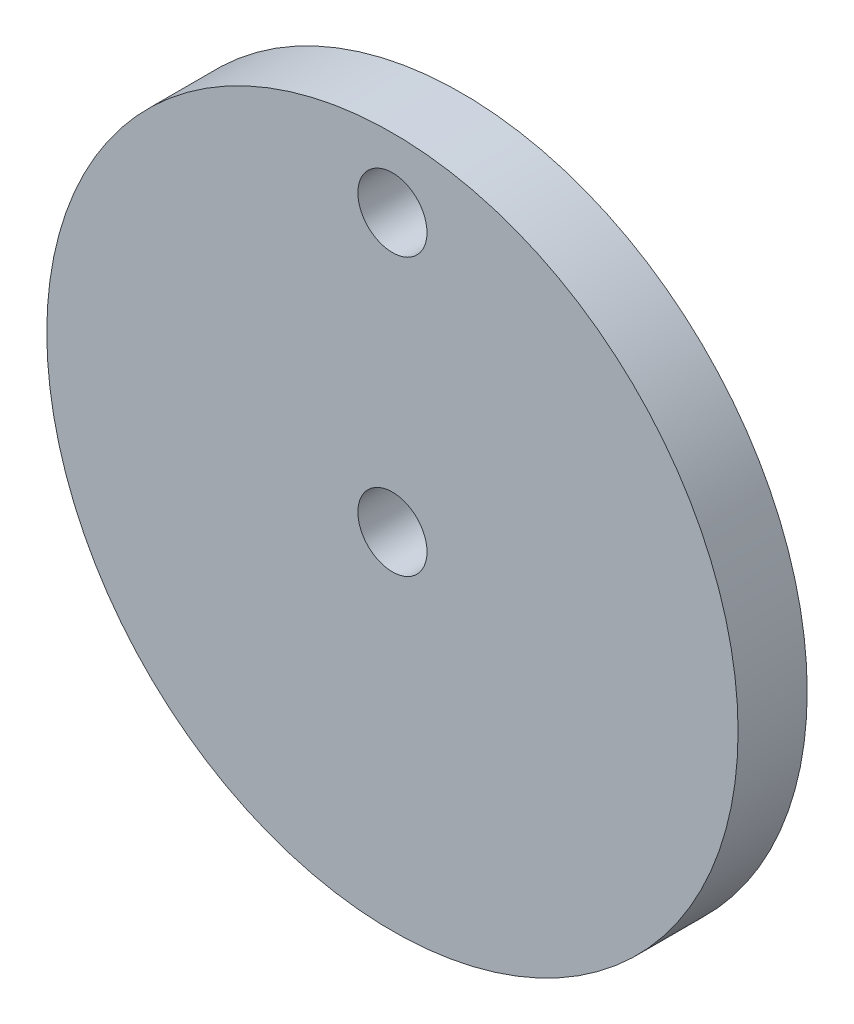
ISO-10303-21;
HEADER;
FILE_DESCRIPTION(('STEP AP214'),'2;1');
FILE_NAME('part.step','',(''),(''),'','','');
FILE_SCHEMA(('AUTOMOTIVE_DESIGN { 1 0 10303 214 1 1 1 1 }'));
ENDSEC;
DATA;
#1=APPLICATION_CONTEXT('core data for automotive mechanical design processes');
#2=APPLICATION_PROTOCOL_DEFINITION('international standard','automotive_design',2000,#1);
#3=PRODUCT_CONTEXT('',#1,'mechanical');
#4=PRODUCT('Part','Part','',(#3));
#5=PRODUCT_RELATED_PRODUCT_CATEGORY('part','',(#4));
#6=PRODUCT_DEFINITION_FORMATION('','',#4);
#7=PRODUCT_DEFINITION_CONTEXT('part definition',#1,'design');
#8=PRODUCT_DEFINITION('design','',#6,#7);
#9=PRODUCT_DEFINITION_SHAPE('','',#8);
#10=(LENGTH_UNIT() NAMED_UNIT(*) SI_UNIT(.MILLI.,.METRE.));
#11=(NAMED_UNIT(*) PLANE_ANGLE_UNIT() SI_UNIT($,.RADIAN.));
#12=(NAMED_UNIT(*) SI_UNIT($,.STERADIAN.) SOLID_ANGLE_UNIT());
#13=UNCERTAINTY_MEASURE_WITH_UNIT(LENGTH_MEASURE(1.E-05),#10,'distance_accuracy_value','');
#14=(GEOMETRIC_REPRESENTATION_CONTEXT(3) GLOBAL_UNCERTAINTY_ASSIGNED_CONTEXT((#13)) GLOBAL_UNIT_ASSIGNED_CONTEXT((#10,
#11,#12)) REPRESENTATION_CONTEXT('',''));
#15=CARTESIAN_POINT('',(0.,0.,0.));
#16=DIRECTION('',(0.,0.,1.));
#17=DIRECTION('',(1.,0.,0.));
#18=AXIS2_PLACEMENT_3D('',#15,#16,#17);
#19=CARTESIAN_POINT('',(0.,0.,10.));
#20=DIRECTION('',(0.,0.,1.));
#21=DIRECTION('',(1.,0.,0.));
#22=AXIS2_PLACEMENT_3D('',#19,#20,#21);
#23=PLANE('',#22);
#24=CARTESIAN_POINT('',(0.,0.,10.));
#25=DIRECTION('',(0.,0.,1.));
#26=DIRECTION('',(1.,0.,0.));
#27=AXIS2_PLACEMENT_3D('',#24,#25,#26);
#28=CIRCLE('',#27,5.);
#29=CARTESIAN_POINT('',(5.,0.,10.));
#30=VERTEX_POINT('',#29);
#31=EDGE_CURVE('E55',#30,#30,#28,.T.);
#32=ORIENTED_EDGE('',*,*,#31,.F.);
#33=EDGE_LOOP('',(#32));
#34=FACE_BOUND('',#33,.T.);
#35=CARTESIAN_POINT('',(0.,0.,10.));
#36=DIRECTION('',(0.,0.,1.));
#37=DIRECTION('',(1.,0.,0.));
#38=AXIS2_PLACEMENT_3D('',#35,#36,#37);
#39=CIRCLE('',#38,50.);
#40=CARTESIAN_POINT('',(50.,0.,10.));
#41=VERTEX_POINT('',#40);
#42=EDGE_CURVE('E12',#41,#41,#39,.T.);
#43=ORIENTED_EDGE('',*,*,#42,.T.);
#44=EDGE_LOOP('',(#43));
#45=FACE_BOUND('',#44,.T.);
#46=CARTESIAN_POINT('',(0.,40.,10.));
#47=DIRECTION('',(0.,0.,1.));
#48=DIRECTION('',(1.,0.,0.));
#49=AXIS2_PLACEMENT_3D('',#46,#47,#48);
#50=CIRCLE('',#49,5.);
#51=CARTESIAN_POINT('',(5.,40.,10.));
#52=VERTEX_POINT('',#51);
#53=EDGE_CURVE('E60',#52,#52,#50,.T.);
#54=ORIENTED_EDGE('',*,*,#53,.F.);
#55=EDGE_LOOP('',(#54));
#56=FACE_BOUND('',#55,.T.);
#57=ADVANCED_FACE('F44',(#34,#45,#56),#23,.T.);
#58=CARTESIAN_POINT('',(0.,0.,0.));
#59=DIRECTION('',(0.,0.,1.));
#60=DIRECTION('',(1.,0.,0.));
#61=AXIS2_PLACEMENT_3D('',#58,#59,#60);
#62=PLANE('',#61);
#63=CARTESIAN_POINT('',(0.,0.,0.));
#64=DIRECTION('',(0.,0.,1.));
#65=DIRECTION('',(1.,0.,0.));
#66=AXIS2_PLACEMENT_3D('',#63,#64,#65);
#67=CIRCLE('',#66,50.);
#68=CARTESIAN_POINT('',(50.,0.,0.));
#69=VERTEX_POINT('',#68);
#70=EDGE_CURVE('E48',#69,#69,#67,.T.);
#71=ORIENTED_EDGE('',*,*,#70,.F.);
#72=EDGE_LOOP('',(#71));
#73=FACE_BOUND('',#72,.T.);
#74=CARTESIAN_POINT('',(0.,0.,0.));
#75=DIRECTION('',(0.,0.,1.));
#76=DIRECTION('',(1.,0.,0.));
#77=AXIS2_PLACEMENT_3D('',#74,#75,#76);
#78=CIRCLE('',#77,5.);
#79=CARTESIAN_POINT('',(5.,0.,0.));
#80=VERTEX_POINT('',#79);
#81=EDGE_CURVE('E57',#80,#80,#78,.T.);
#82=ORIENTED_EDGE('',*,*,#81,.T.);
#83=EDGE_LOOP('',(#82));
#84=FACE_BOUND('',#83,.T.);
#85=CARTESIAN_POINT('',(0.,40.,0.));
#86=DIRECTION('',(0.,0.,1.));
#87=DIRECTION('',(1.,0.,0.));
#88=AXIS2_PLACEMENT_3D('',#85,#86,#87);
#89=CIRCLE('',#88,5.);
#90=CARTESIAN_POINT('',(5.,40.,0.));
#91=VERTEX_POINT('',#90);
#92=EDGE_CURVE('E63',#91,#91,#89,.T.);
#93=ORIENTED_EDGE('',*,*,#92,.T.);
#94=EDGE_LOOP('',(#93));
#95=FACE_BOUND('',#94,.T.);
#96=ADVANCED_FACE('F73',(#73,#84,#95),#62,.F.);
#97=CARTESIAN_POINT('',(0.,0.,10.));
#98=DIRECTION('',(0.,0.,-1.));
#99=DIRECTION('',(-1.,0.,0.));
#100=AXIS2_PLACEMENT_3D('',#97,#98,#99);
#101=CYLINDRICAL_SURFACE('',#100,50.);
#102=ORIENTED_EDGE('',*,*,#42,.F.);
#103=EDGE_LOOP('',(#102));
#104=FACE_BOUND('',#103,.T.);
#105=ORIENTED_EDGE('',*,*,#70,.T.);
#106=EDGE_LOOP('',(#105));
#107=FACE_BOUND('',#106,.T.);
#108=ADVANCED_FACE('F46',(#104,#107),#101,.T.);
#109=CARTESIAN_POINT('',(0.,0.,10.));
#110=DIRECTION('',(0.,0.,-1.));
#111=DIRECTION('',(-1.,0.,0.));
#112=AXIS2_PLACEMENT_3D('',#109,#110,#111);
#113=CYLINDRICAL_SURFACE('',#112,5.);
#114=ORIENTED_EDGE('',*,*,#31,.T.);
#115=EDGE_LOOP('',(#114));
#116=FACE_BOUND('',#115,.T.);
#117=ORIENTED_EDGE('',*,*,#81,.F.);
#118=EDGE_LOOP('',(#117));
#119=FACE_BOUND('',#118,.T.);
#120=ADVANCED_FACE('F82',(#116,#119),#113,.F.);
#121=CARTESIAN_POINT('',(0.,40.,10.));
#122=DIRECTION('',(0.,0.,-1.));
#123=DIRECTION('',(-1.,0.,0.));
#124=AXIS2_PLACEMENT_3D('',#121,#122,#123);
#125=CYLINDRICAL_SURFACE('',#124,5.);
#126=ORIENTED_EDGE('',*,*,#53,.T.);
#127=EDGE_LOOP('',(#126));
#128=FACE_BOUND('',#127,.T.);
#129=ORIENTED_EDGE('',*,*,#92,.F.);
#130=EDGE_LOOP('',(#129));
#131=FACE_BOUND('',#130,.T.);
#132=ADVANCED_FACE('F69',(#128,#131),#125,.F.);
#133=CLOSED_SHELL('',(#57,#96,#108,#120,#132));
#134=MANIFOLD_SOLID_BREP('B2',#133);
#135=ADVANCED_BREP_SHAPE_REPRESENTATION('',(#18,#134),#14);
#136=SHAPE_DEFINITION_REPRESENTATION(#9,#135);
ENDSEC;
END-ISO-10303-21;
